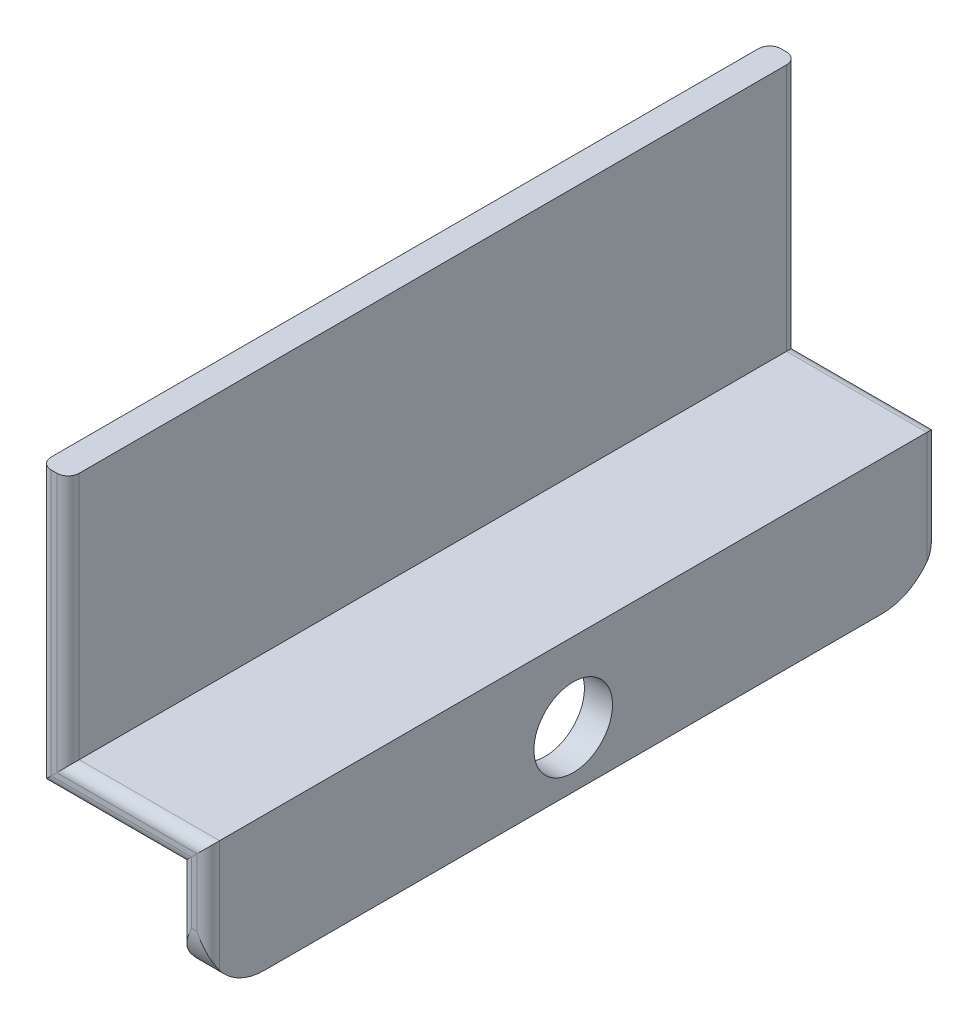
ISO-10303-21;
HEADER;
FILE_DESCRIPTION(('STEP AP214'),'2;1');
FILE_NAME('part.step','',(''),(''),'','','');
FILE_SCHEMA(('AUTOMOTIVE_DESIGN { 1 0 10303 214 1 1 1 1 }'));
ENDSEC;
DATA;
#1=APPLICATION_CONTEXT('core data for automotive mechanical design processes');
#2=APPLICATION_PROTOCOL_DEFINITION('international standard','automotive_design',2000,#1);
#3=PRODUCT_CONTEXT('',#1,'mechanical');
#4=PRODUCT('Part','Part','',(#3));
#5=PRODUCT_RELATED_PRODUCT_CATEGORY('part','',(#4));
#6=PRODUCT_DEFINITION_FORMATION('','',#4);
#7=PRODUCT_DEFINITION_CONTEXT('part definition',#1,'design');
#8=PRODUCT_DEFINITION('design','',#6,#7);
#9=PRODUCT_DEFINITION_SHAPE('','',#8);
#10=(LENGTH_UNIT() NAMED_UNIT(*) SI_UNIT(.MILLI.,.METRE.));
#11=(NAMED_UNIT(*) PLANE_ANGLE_UNIT() SI_UNIT($,.RADIAN.));
#12=(NAMED_UNIT(*) SI_UNIT($,.STERADIAN.) SOLID_ANGLE_UNIT());
#13=UNCERTAINTY_MEASURE_WITH_UNIT(LENGTH_MEASURE(1.E-05),#10,'distance_accuracy_value','');
#14=(GEOMETRIC_REPRESENTATION_CONTEXT(3) GLOBAL_UNCERTAINTY_ASSIGNED_CONTEXT((#13)) GLOBAL_UNIT_ASSIGNED_CONTEXT((#10,
#11,#12)) REPRESENTATION_CONTEXT('',''));
#15=CARTESIAN_POINT('',(0.,0.,0.));
#16=DIRECTION('',(0.,0.,1.));
#17=DIRECTION('',(1.,0.,0.));
#18=AXIS2_PLACEMENT_3D('',#15,#16,#17);
#19=CARTESIAN_POINT('',(-0.499999999999993,10.,55.));
#20=DIRECTION('',(1.,0.,0.));
#21=DIRECTION('',(0.,0.,-1.));
#22=AXIS2_PLACEMENT_3D('',#19,#20,#21);
#23=CYLINDRICAL_SURFACE('',#22,10.);
#24=DIRECTION('',(1.,0.,0.));
#25=VECTOR('',#24,1.);
#26=CARTESIAN_POINT('',(-0.499999999999993,10.,65.));
#27=LINE('',#26,#25);
#28=CARTESIAN_POINT('',(-0.499999999999993,10.,65.));
#29=VERTEX_POINT('',#28);
#30=CARTESIAN_POINT('',(0.500000000000008,10.,65.));
#31=VERTEX_POINT('',#30);
#32=EDGE_CURVE('E348',#29,#31,#27,.T.);
#33=ORIENTED_EDGE('',*,*,#32,.F.);
#34=CARTESIAN_POINT('',(-2.49999999999999,4.00000000000001,63.));
#35=CARTESIAN_POINT('',(-2.49999547043244,4.06304637753697,63.0472862882958));
#36=CARTESIAN_POINT('',(-2.49832361454912,4.12663757747305,63.093813478753));
#37=CARTESIAN_POINT('',(-2.49192859183356,4.25478005250355,63.1852695333377));
#38=CARTESIAN_POINT('',(-2.48720638983413,4.31933101771625,63.2301988981225));
#39=CARTESIAN_POINT('',(-2.46891171954804,4.51402968416605,63.3623378279782));
#40=CARTESIAN_POINT('',(-2.45120888558428,4.64547618874946,63.4470878572115));
#41=CARTESIAN_POINT('',(-2.40682523983019,4.91010869140637,63.6091190391928));
#42=CARTESIAN_POINT('',(-2.38020606759935,5.0432768704808,63.6864469043147));
#43=CARTESIAN_POINT('',(-2.31945242255605,5.31177170751565,63.8342526275325));
#44=CARTESIAN_POINT('',(-2.28531301078787,5.44709972953324,63.904725939813));
#45=CARTESIAN_POINT('',(-2.18706305090996,5.8061393307985,64.0814771097219));
#46=CARTESIAN_POINT('',(-2.11770825700137,6.03127255594251,64.1819879312216));
#47=CARTESIAN_POINT('',(-1.96662002756913,6.48468424964298,64.364955146067));
#48=CARTESIAN_POINT('',(-1.88488135721311,6.71296401101095,64.4474038680966));
#49=CARTESIAN_POINT('',(-1.7119794583594,7.17260428488559,64.5950152471494));
#50=CARTESIAN_POINT('',(-1.6207807482313,7.40397333561157,64.6601092975224));
#51=CARTESIAN_POINT('',(-1.43190515621657,7.86814150222461,64.7730351186085));
#52=CARTESIAN_POINT('',(-1.3342303647904,8.10094013484107,64.8208724279425));
#53=CARTESIAN_POINT('',(-1.11715554079996,8.60820812759128,64.9065704488633));
#54=CARTESIAN_POINT('',(-0.996936925704238,8.88286585590204,64.9412373642432));
#55=CARTESIAN_POINT('',(-0.753857161670149,9.43229712763855,64.9876693958687));
#56=CARTESIAN_POINT('',(-0.631002027540831,9.70706924260041,64.9994819850184));
#57=CARTESIAN_POINT('',(-0.505443288842875,9.98782843433309,64.99999444154));
#58=CARTESIAN_POINT('',(-0.502721632048848,9.99391424381279,64.9999999968566));
#59=CARTESIAN_POINT('',(-0.499999999999993,10.,65.));
#60=B_SPLINE_CURVE_WITH_KNOTS('',3,(#34,#35,#36,#37,#38,#39,#40,#41,#42,#43,#44,#45,#46,#47,#48,
#49,#50,#51,#52,#53,#54,#55,#56,#57,#58,#59),.UNSPECIFIED.,.F.,.F.,(4,2,2,2,2,2,2,2,2,2,2,2,4),
(0.,0.236371159892512,0.472667591527449,0.944315101861264,1.41276713949794,1.88152775757087,
2.64870335126649,3.41620414998905,4.18669550285099,4.95693934291841,5.86148159841717,
6.76414291697835,6.78414292392341),.UNSPECIFIED.);
#61=CARTESIAN_POINT('',(-2.49999999999999,4.00000000000001,63.));
#62=VERTEX_POINT('',#61);
#63=EDGE_CURVE('E11',#62,#29,#60,.T.);
#64=ORIENTED_EDGE('',*,*,#63,.F.);
#65=CARTESIAN_POINT('',(-2.49999999999999,10.,55.));
#66=DIRECTION('',(-1.,0.,0.));
#67=DIRECTION('',(0.,0.,1.));
#68=AXIS2_PLACEMENT_3D('',#65,#66,#67);
#69=CIRCLE('',#68,10.);
#70=CARTESIAN_POINT('',(-2.49999999999999,0.,55.));
#71=VERTEX_POINT('',#70);
#72=EDGE_CURVE('E50',#71,#62,#69,.T.);
#73=ORIENTED_EDGE('',*,*,#72,.F.);
#74=DIRECTION('',(1.,0.,0.));
#75=VECTOR('',#74,1.);
#76=CARTESIAN_POINT('',(0.499999999999992,0.,55.));
#77=LINE('',#76,#75);
#78=CARTESIAN_POINT('',(2.50000000000001,0.,55.));
#79=VERTEX_POINT('',#78);
#80=EDGE_CURVE('E475',#79,#71,#77,.F.);
#81=ORIENTED_EDGE('',*,*,#80,.F.);
#82=CARTESIAN_POINT('',(2.50000000000001,10.,55.));
#83=DIRECTION('',(1.,0.,0.));
#84=DIRECTION('',(0.,0.,-1.));
#85=AXIS2_PLACEMENT_3D('',#82,#83,#84);
#86=CIRCLE('',#85,10.);
#87=CARTESIAN_POINT('',(2.50000000000001,4.00000000000001,63.));
#88=VERTEX_POINT('',#87);
#89=EDGE_CURVE('E476',#88,#79,#86,.T.);
#90=ORIENTED_EDGE('',*,*,#89,.F.);
#91=CARTESIAN_POINT('',(0.500000000000008,10.,65.));
#92=CARTESIAN_POINT('',(0.502721628399615,9.99391425084165,64.9999999965994));
#93=CARTESIAN_POINT('',(0.505443285212219,9.98782844131885,64.9999944412989));
#94=CARTESIAN_POINT('',(0.642839640476698,9.68059946278816,64.999433683535));
#95=CARTESIAN_POINT('',(0.777544798684673,9.37932057803113,64.9852882408832));
#96=CARTESIAN_POINT('',(1.04327113471868,8.77740035527913,64.9295886716854));
#97=CARTESIAN_POINT('',(1.17428874575255,8.47675987815172,64.8880088990259));
#98=CARTESIAN_POINT('',(1.42867458267128,7.87673702040747,64.7767569341569));
#99=CARTESIAN_POINT('',(1.55202957555319,7.57735760535633,64.7070376217039));
#100=CARTESIAN_POINT('',(1.78572898308166,6.98194801878022,64.5387111228695));
#101=CARTESIAN_POINT('',(1.89608655158132,6.68591474005417,64.4401335005981));
#102=CARTESIAN_POINT('',(2.09232369803455,6.11354886559747,64.2187128467075));
#103=CARTESIAN_POINT('',(2.17916593611921,5.83698257130332,64.0973671885433));
#104=CARTESIAN_POINT('',(2.29024836784087,5.42797135928678,63.8949186385683));
#105=CARTESIAN_POINT('',(2.32402390435839,5.29290748653502,63.8242143371832));
#106=CARTESIAN_POINT('',(2.38402833961434,5.02484413603067,63.6759018440058));
#107=CARTESIAN_POINT('',(2.41025661874056,4.89184482862158,63.5982930860581));
#108=CARTESIAN_POINT('',(2.45026840218955,4.64893178433829,63.4488538806291));
#109=CARTESIAN_POINT('',(2.46535101868504,4.5386363826575,63.3779936451009));
#110=CARTESIAN_POINT('',(2.48791968612418,4.32044190393643,63.2316379999814));
#111=CARTESIAN_POINT('',(2.49541038857459,4.21254139925162,63.1561454586777));
#112=CARTESIAN_POINT('',(2.50153963009505,3.99856716219276,63.000031068604));
#113=CARTESIAN_POINT('',(2.50009094149456,3.89252158861953,62.9193663015082));
#114=CARTESIAN_POINT('',(2.48994271305687,3.73615542879902,62.7954277633358));
#115=CARTESIAN_POINT('',(2.48522141633947,3.68442974533144,62.75357823854));
#116=CARTESIAN_POINT('',(2.47288472291966,3.58201051799564,62.6690174067095));
#117=CARTESIAN_POINT('',(2.46526832160248,3.53131733885191,62.6263058054075));
#118=CARTESIAN_POINT('',(2.4560925472339,3.48120344431526,62.5832243449335));
#119=B_SPLINE_CURVE_WITH_KNOTS('',3,(#91,#92,#93,#94,#95,#96,#97,#98,#99,#100,#101,#102,#103,
#104,#105,#106,#107,#108,#109,#110,#111,#112,#113,#114,#115,#116,#117,#118),.UNSPECIFIED.,.F.,
.F.,(4,2,2,2,2,2,2,2,2,2,2,2,2,4),(0.,0.0200000069444667,1.00964805019351,2.00022254779432,
2.99246271075223,3.98368990203602,4.9242652636444,5.3924313134945,5.86063578772613,
6.2562352909762,6.65159226669092,7.05081306741995,7.25085282834555,7.45096206746141),.UNSPECIFIED.);
#120=EDGE_CURVE('E433',#31,#88,#119,.T.);
#121=ORIENTED_EDGE('',*,*,#120,.F.);
#122=EDGE_LOOP('',(#33,#64,#73,#81,#90,#121));
#123=FACE_BOUND('',#122,.T.);
#124=ADVANCED_FACE('F37',(#123),#23,.T.);
#125=CARTESIAN_POINT('',(-0.500000000000008,10.,-55.));
#126=DIRECTION('',(-1.,0.,0.));
#127=DIRECTION('',(0.,0.,1.));
#128=AXIS2_PLACEMENT_3D('',#125,#126,#127);
#129=CYLINDRICAL_SURFACE('',#128,10.);
#130=DIRECTION('',(-1.,0.,0.));
#131=VECTOR('',#130,1.);
#132=CARTESIAN_POINT('',(-0.500000000000008,10.,-65.));
#133=LINE('',#132,#131);
#134=CARTESIAN_POINT('',(0.499999999999992,10.,-65.));
#135=VERTEX_POINT('',#134);
#136=CARTESIAN_POINT('',(-0.500000000000008,10.,-65.));
#137=VERTEX_POINT('',#136);
#138=EDGE_CURVE('E169',#135,#137,#133,.T.);
#139=ORIENTED_EDGE('',*,*,#138,.F.);
#140=CARTESIAN_POINT('',(2.49999999999999,3.99999999999999,-63.));
#141=CARTESIAN_POINT('',(2.49999547043244,4.06304637753687,-63.0472862882957));
#142=CARTESIAN_POINT('',(2.49832361454912,4.12663757747287,-63.0938134787529));
#143=CARTESIAN_POINT('',(2.49192859183358,4.2547800525032,-63.1852695333375));
#144=CARTESIAN_POINT('',(2.48720638983416,4.31933101771581,-63.2301988981222));
#145=CARTESIAN_POINT('',(2.46891171954812,4.51402968416534,-63.3623378279777));
#146=CARTESIAN_POINT('',(2.4512088855844,4.64547618874857,-63.447087857211));
#147=CARTESIAN_POINT('',(2.40682523983037,4.91010869140545,-63.6091190391923));
#148=CARTESIAN_POINT('',(2.3802060675995,5.04327687048006,-63.6864469043143));
#149=CARTESIAN_POINT('',(2.31945242255614,5.31177170751526,-63.8342526275324));
#150=CARTESIAN_POINT('',(2.28531301078792,5.44709972953303,-63.904725939813));
#151=CARTESIAN_POINT('',(2.18706305090993,5.8061393307986,-64.0814771097219));
#152=CARTESIAN_POINT('',(2.11770825700131,6.03127255594274,-64.1819879312217));
#153=CARTESIAN_POINT('',(1.96662002756895,6.48468424964342,-64.3649551460672));
#154=CARTESIAN_POINT('',(1.88488135721282,6.71296401101147,-64.4474038680968));
#155=CARTESIAN_POINT('',(1.71197945835927,7.17260428488616,-64.5950152471496));
#156=CARTESIAN_POINT('',(1.62078074823145,7.4039733356121,-64.6601092975225));
#157=CARTESIAN_POINT('',(1.43190515621617,7.86814150222462,-64.7730351186086));
#158=CARTESIAN_POINT('',(1.33423036478917,8.10094013484059,-64.8208724279425));
#159=CARTESIAN_POINT('',(1.11715554080136,8.60820812759183,-64.9065704488633));
#160=CARTESIAN_POINT('',(0.996936925709866,8.88286585590448,-64.9412373642432));
#161=CARTESIAN_POINT('',(0.753857161664523,9.43229712763598,-64.9876693958688));
#162=CARTESIAN_POINT('',(0.631002027519763,9.70706924259096,-64.9994819850186));
#163=CARTESIAN_POINT('',(0.505443288841949,9.98782843433267,-64.99999444154));
#164=CARTESIAN_POINT('',(0.502721632048376,9.99391424381258,-64.9999999968566));
#165=CARTESIAN_POINT('',(0.499999999999992,10.,-65.));
#166=B_SPLINE_CURVE_WITH_KNOTS('',3,(#140,#141,#142,#143,#144,#145,#146,#147,#148,#149,#150,
#151,#152,#153,#154,#155,#156,#157,#158,#159,#160,#161,#162,#163,#164,#165),.UNSPECIFIED.,.F.,
.F.,(4,2,2,2,2,2,2,2,2,2,2,2,4),(0.,0.236371159892205,0.47266759152683,0.944315101860007,
1.4127671394973,1.88152775757086,2.6487033512669,3.4162041499898,4.1866955028513,
4.95693934291837,5.8614815984171,6.76414291697836,6.78414292392343),.UNSPECIFIED.);
#167=CARTESIAN_POINT('',(2.49999999999999,3.99999999999999,-63.));
#168=VERTEX_POINT('',#167);
#169=EDGE_CURVE('E340',#168,#135,#166,.T.);
#170=ORIENTED_EDGE('',*,*,#169,.F.);
#171=CARTESIAN_POINT('',(2.49999999999999,10.,-55.));
#172=DIRECTION('',(1.,0.,0.));
#173=DIRECTION('',(0.,0.,-1.));
#174=AXIS2_PLACEMENT_3D('',#171,#172,#173);
#175=CIRCLE('',#174,10.);
#176=CARTESIAN_POINT('',(2.49999999999999,0.,-55.));
#177=VERTEX_POINT('',#176);
#178=EDGE_CURVE('E349',#177,#168,#175,.T.);
#179=ORIENTED_EDGE('',*,*,#178,.F.);
#180=DIRECTION('',(-1.,0.,0.));
#181=VECTOR('',#180,1.);
#182=CARTESIAN_POINT('',(0.499999999999992,0.,-55.));
#183=LINE('',#182,#181);
#184=CARTESIAN_POINT('',(-2.50000000000001,0.,-55.));
#185=VERTEX_POINT('',#184);
#186=EDGE_CURVE('E675',#185,#177,#183,.F.);
#187=ORIENTED_EDGE('',*,*,#186,.F.);
#188=CARTESIAN_POINT('',(-2.50000000000001,10.,-55.));
#189=DIRECTION('',(-1.,0.,0.));
#190=DIRECTION('',(0.,0.,1.));
#191=AXIS2_PLACEMENT_3D('',#188,#189,#190);
#192=CIRCLE('',#191,10.);
#193=CARTESIAN_POINT('',(-2.50000000000001,3.99999999999999,-63.));
#194=VERTEX_POINT('',#193);
#195=EDGE_CURVE('E326',#194,#185,#192,.T.);
#196=ORIENTED_EDGE('',*,*,#195,.F.);
#197=CARTESIAN_POINT('',(-0.500000000000008,10.,-65.));
#198=CARTESIAN_POINT('',(-0.502721628399066,9.99391425084141,-64.9999999965994));
#199=CARTESIAN_POINT('',(-0.505443285211139,9.98782844131837,-64.9999944412989));
#200=CARTESIAN_POINT('',(-0.642839640444456,9.68059946278795,-64.9994336835353));
#201=CARTESIAN_POINT('',(-0.777544798666836,9.37932057805158,-64.9852882408844));
#202=CARTESIAN_POINT('',(-1.04327113470509,8.77740035532974,-64.9295886716909));
#203=CARTESIAN_POINT('',(-1.17428874572878,8.47675987821183,-64.8880088990346));
#204=CARTESIAN_POINT('',(-1.42867458263471,7.87673702048958,-64.7767569341746));
#205=CARTESIAN_POINT('',(-1.55202957551402,7.57735760545096,-64.7070376217272));
#206=CARTESIAN_POINT('',(-1.78572898303726,6.98194801889843,-64.5387111229064));
#207=CARTESIAN_POINT('',(-1.89608655153428,6.68591474018346,-64.440133500643));
#208=CARTESIAN_POINT('',(-2.09232369799681,6.11354886571502,-64.2187128467578));
#209=CARTESIAN_POINT('',(-2.1791659360912,5.83698257139857,-64.0973671885877));
#210=CARTESIAN_POINT('',(-2.29024836782501,5.42797135934904,-63.8949186386005));
#211=CARTESIAN_POINT('',(-2.3240239043462,5.2929074865863,-63.8242143372107));
#212=CARTESIAN_POINT('',(-2.38402833960843,5.02484413606024,-63.675901844023));
#213=CARTESIAN_POINT('',(-2.41025661873727,4.89184482864045,-63.5982930860695));
#214=CARTESIAN_POINT('',(-2.45026840218792,4.64893178434909,-63.448853880636));
#215=CARTESIAN_POINT('',(-2.46535101868332,4.53863638267071,-63.3779936451095));
#216=CARTESIAN_POINT('',(-2.48791968612268,4.32044190395432,-63.2316379999937));
#217=CARTESIAN_POINT('',(-2.49541038857339,4.21254139927179,-63.156145458692));
#218=CARTESIAN_POINT('',(-2.50153963009495,3.99856716221775,-63.0000310686227));
#219=CARTESIAN_POINT('',(-2.5000909414953,3.89252158864704,-62.9193663015294));
#220=CARTESIAN_POINT('',(-2.48994271305941,3.73615542883011,-62.7954277633608));
#221=CARTESIAN_POINT('',(-2.4852214163427,3.68442974536369,-62.7535782385662));
#222=CARTESIAN_POINT('',(-2.47288472292447,3.58201051803014,-62.6690174067384));
#223=CARTESIAN_POINT('',(-2.46526832160818,3.53131733888749,-62.6263058054377));
#224=CARTESIAN_POINT('',(-2.45609254724062,3.48120344435189,-62.583224344965));
#225=B_SPLINE_CURVE_WITH_KNOTS('',3,(#197,#198,#199,#200,#201,#202,#203,#204,#205,#206,#207,
#208,#209,#210,#211,#212,#213,#214,#215,#216,#217,#218,#219,#220,#221,#222,#223,#224),
.UNSPECIFIED.,.F.,.F.,(4,2,2,2,2,2,2,2,2,2,2,2,2,4),(0.,0.0200000069444654,1.00964805015461,
2.00022254771616,2.99246271063398,3.98368990187851,4.92426526356025,5.39243131344749,
5.86063578771627,6.25623529095746,6.65159226666328,7.05081306738183,7.25085282830217,
7.45096206741274),.UNSPECIFIED.);
#226=EDGE_CURVE('E202',#137,#194,#225,.T.);
#227=ORIENTED_EDGE('',*,*,#226,.F.);
#228=EDGE_LOOP('',(#139,#170,#179,#187,#196,#227));
#229=FACE_BOUND('',#228,.T.);
#230=ADVANCED_FACE('F331',(#229),#129,.T.);
#231=CARTESIAN_POINT('',(-24.5,68.2,-63.0000000000001));
#232=DIRECTION('',(0.,-1.,0.));
#233=DIRECTION('',(0.,0.,-1.));
#234=AXIS2_PLACEMENT_3D('',#231,#232,#233);
#235=PLANE('',#234);
#236=CARTESIAN_POINT('',(-24.5,68.2,-63.0000000000001));
#237=DIRECTION('',(0.,1.,0.));
#238=DIRECTION('',(0.,0.,-1.));
#239=AXIS2_PLACEMENT_3D('',#236,#237,#238);
#240=CIRCLE('',#239,2.);
#241=CARTESIAN_POINT('',(-22.5,68.2,-63.0000000000001));
#242=VERTEX_POINT('',#241);
#243=CARTESIAN_POINT('',(-24.5,68.2,-65.0000000000001));
#244=VERTEX_POINT('',#243);
#245=EDGE_CURVE('E278',#242,#244,#240,.T.);
#246=ORIENTED_EDGE('',*,*,#245,.T.);
#247=DIRECTION('',(-1.,0.,0.));
#248=VECTOR('',#247,1.);
#249=CARTESIAN_POINT('',(-25.5,68.2,-65.0000000000001));
#250=LINE('',#249,#248);
#251=CARTESIAN_POINT('',(-25.5,68.2,-65.0000000000001));
#252=VERTEX_POINT('',#251);
#253=EDGE_CURVE('E293',#244,#252,#250,.T.);
#254=ORIENTED_EDGE('',*,*,#253,.T.);
#255=CARTESIAN_POINT('',(-25.5,68.2,-63.0000000000001));
#256=DIRECTION('',(0.,1.,0.));
#257=DIRECTION('',(0.,0.,-1.));
#258=AXIS2_PLACEMENT_3D('',#255,#256,#257);
#259=CIRCLE('',#258,2.);
#260=CARTESIAN_POINT('',(-27.5,68.2,-63.0000000000001));
#261=VERTEX_POINT('',#260);
#262=EDGE_CURVE('E291',#252,#261,#259,.T.);
#263=ORIENTED_EDGE('',*,*,#262,.T.);
#264=DIRECTION('',(0.,0.,1.));
#265=VECTOR('',#264,1.);
#266=CARTESIAN_POINT('',(-27.5,68.2,-63.0000000000001));
#267=LINE('',#266,#265);
#268=CARTESIAN_POINT('',(-27.5,68.2,62.9999999999999));
#269=VERTEX_POINT('',#268);
#270=EDGE_CURVE('E289',#261,#269,#267,.T.);
#271=ORIENTED_EDGE('',*,*,#270,.T.);
#272=CARTESIAN_POINT('',(-25.5,68.2,62.9999999999999));
#273=DIRECTION('',(0.,1.,0.));
#274=DIRECTION('',(0.,0.,-1.));
#275=AXIS2_PLACEMENT_3D('',#272,#273,#274);
#276=CIRCLE('',#275,2.);
#277=CARTESIAN_POINT('',(-25.5,68.2,64.9999999999999));
#278=VERTEX_POINT('',#277);
#279=EDGE_CURVE('E287',#269,#278,#276,.T.);
#280=ORIENTED_EDGE('',*,*,#279,.T.);
#281=DIRECTION('',(1.,0.,0.));
#282=VECTOR('',#281,1.);
#283=CARTESIAN_POINT('',(-25.5,68.2,64.9999999999999));
#284=LINE('',#283,#282);
#285=CARTESIAN_POINT('',(-24.5,68.2,64.9999999999999));
#286=VERTEX_POINT('',#285);
#287=EDGE_CURVE('E285',#278,#286,#284,.T.);
#288=ORIENTED_EDGE('',*,*,#287,.T.);
#289=CARTESIAN_POINT('',(-24.5,68.2,62.9999999999999));
#290=DIRECTION('',(0.,1.,0.));
#291=DIRECTION('',(0.,0.,-1.));
#292=AXIS2_PLACEMENT_3D('',#289,#290,#291);
#293=CIRCLE('',#292,2.);
#294=CARTESIAN_POINT('',(-22.5,68.2,62.9999999999999));
#295=VERTEX_POINT('',#294);
#296=EDGE_CURVE('E283',#286,#295,#293,.T.);
#297=ORIENTED_EDGE('',*,*,#296,.T.);
#298=DIRECTION('',(0.,0.,-1.));
#299=VECTOR('',#298,1.);
#300=CARTESIAN_POINT('',(-22.5,68.2,-63.0000000000001));
#301=LINE('',#300,#299);
#302=EDGE_CURVE('E280',#295,#242,#301,.T.);
#303=ORIENTED_EDGE('',*,*,#302,.T.);
#304=EDGE_LOOP('',(#246,#254,#263,#271,#280,#288,#297,#303));
#305=FACE_BOUND('',#304,.T.);
#306=ADVANCED_FACE('F335',(#305),#235,.F.);
#307=CARTESIAN_POINT('',(0.499999999999992,0.,-63.));
#308=DIRECTION('',(0.,-1.,0.));
#309=DIRECTION('',(0.,0.,-1.));
#310=AXIS2_PLACEMENT_3D('',#307,#308,#309);
#311=PLANE('',#310);
#312=DIRECTION('',(0.,0.,-1.));
#313=VECTOR('',#312,1.);
#314=CARTESIAN_POINT('',(2.49999999999999,0.,-63.));
#315=LINE('',#314,#313);
#316=EDGE_CURVE('E224',#79,#177,#315,.T.);
#317=ORIENTED_EDGE('',*,*,#316,.F.);
#318=ORIENTED_EDGE('',*,*,#80,.T.);
#319=DIRECTION('',(0.,0.,1.));
#320=VECTOR('',#319,1.);
#321=CARTESIAN_POINT('',(-2.50000000000001,0.,-63.));
#322=LINE('',#321,#320);
#323=EDGE_CURVE('E227',#185,#71,#322,.T.);
#324=ORIENTED_EDGE('',*,*,#323,.F.);
#325=ORIENTED_EDGE('',*,*,#186,.T.);
#326=EDGE_LOOP('',(#317,#318,#324,#325));
#327=FACE_BOUND('',#326,.T.);
#328=ADVANCED_FACE('F392',(#327),#311,.T.);
#329=CARTESIAN_POINT('',(-25.5,18.6499999999999,-65.0000000000001));
#330=DIRECTION('',(0.,0.,-1.));
#331=DIRECTION('',(0.,1.,0.));
#332=AXIS2_PLACEMENT_3D('',#329,#330,#331);
#333=PLANE('',#332);
#334=DIRECTION('',(0.707106781186548,0.707106781186548,0.));
#335=VECTOR('',#334,1.);
#336=CARTESIAN_POINT('',(-11.3249999999999,35.175,-65.0000000000001));
#337=LINE('',#336,#335);
#338=CARTESIAN_POINT('',(-25.5,20.9999999999999,-65.0000000000001));
#339=VERTEX_POINT('',#338);
#340=CARTESIAN_POINT('',(-24.5,21.9999999999999,-65.0000000000001));
#341=VERTEX_POINT('',#340);
#342=EDGE_CURVE('E258',#339,#341,#337,.T.);
#343=ORIENTED_EDGE('',*,*,#342,.F.);
#344=DIRECTION('',(0.,1.,0.));
#345=VECTOR('',#344,1.);
#346=CARTESIAN_POINT('',(-25.5,18.6499999999999,-65.0000000000001));
#347=LINE('',#346,#345);
#348=EDGE_CURVE('E313',#339,#252,#347,.T.);
#349=ORIENTED_EDGE('',*,*,#348,.T.);
#350=ORIENTED_EDGE('',*,*,#253,.F.);
#351=DIRECTION('',(0.,1.,0.));
#352=VECTOR('',#351,1.);
#353=CARTESIAN_POINT('',(-24.5,18.6499999999999,-65.0000000000001));
#354=LINE('',#353,#352);
#355=EDGE_CURVE('E263',#341,#244,#354,.T.);
#356=ORIENTED_EDGE('',*,*,#355,.F.);
#357=EDGE_LOOP('',(#343,#349,#350,#356));
#358=FACE_BOUND('',#357,.T.);
#359=ADVANCED_FACE('F388',(#358),#333,.T.);
#360=CARTESIAN_POINT('',(-25.5,18.6499999999999,-63.0000000000001));
#361=DIRECTION('',(0.,1.,0.));
#362=DIRECTION('',(0.,0.,1.));
#363=AXIS2_PLACEMENT_3D('',#360,#361,#362);
#364=CYLINDRICAL_SURFACE('',#363,2.);
#365=CARTESIAN_POINT('',(-25.5,20.9999999999998,-63.0000000000001));
#366=DIRECTION('',(-0.707106781186547,0.707106781186547,0.));
#367=DIRECTION('',(-0.707106781186548,-0.707106781186548,0.));
#368=AXIS2_PLACEMENT_3D('',#365,#366,#367);
#369=ELLIPSE('',#368,2.82842712474619,2.);
#370=CARTESIAN_POINT('',(-27.5,18.9999999999999,-63.0000000000001));
#371=VERTEX_POINT('',#370);
#372=EDGE_CURVE('E195',#371,#339,#369,.F.);
#373=ORIENTED_EDGE('',*,*,#372,.F.);
#374=DIRECTION('',(0.,1.,0.));
#375=VECTOR('',#374,1.);
#376=CARTESIAN_POINT('',(-27.5,18.6499999999999,-63.0000000000001));
#377=LINE('',#376,#375);
#378=EDGE_CURVE('E310',#371,#261,#377,.T.);
#379=ORIENTED_EDGE('',*,*,#378,.T.);
#380=ORIENTED_EDGE('',*,*,#262,.F.);
#381=ORIENTED_EDGE('',*,*,#348,.F.);
#382=EDGE_LOOP('',(#373,#379,#380,#381));
#383=FACE_BOUND('',#382,.T.);
#384=ADVANCED_FACE('F391',(#383),#364,.T.);
#385=CARTESIAN_POINT('',(-27.5,18.6499999999999,-63.0000000000001));
#386=DIRECTION('',(-1.,0.,0.));
#387=DIRECTION('',(0.,0.,1.));
#388=AXIS2_PLACEMENT_3D('',#385,#386,#387);
#389=PLANE('',#388);
#390=DIRECTION('',(0.,0.,-1.));
#391=VECTOR('',#390,1.);
#392=CARTESIAN_POINT('',(-27.5,18.9999999999998,-63.));
#393=LINE('',#392,#391);
#394=CARTESIAN_POINT('',(-27.5,19.0000000000001,62.9999999999999));
#395=VERTEX_POINT('',#394);
#396=EDGE_CURVE('E240',#395,#371,#393,.T.);
#397=ORIENTED_EDGE('',*,*,#396,.F.);
#398=DIRECTION('',(0.,1.,0.));
#399=VECTOR('',#398,1.);
#400=CARTESIAN_POINT('',(-27.5,18.6499999999999,62.9999999999999));
#401=LINE('',#400,#399);
#402=EDGE_CURVE('E307',#395,#269,#401,.T.);
#403=ORIENTED_EDGE('',*,*,#402,.T.);
#404=ORIENTED_EDGE('',*,*,#270,.F.);
#405=ORIENTED_EDGE('',*,*,#378,.F.);
#406=EDGE_LOOP('',(#397,#403,#404,#405));
#407=FACE_BOUND('',#406,.T.);
#408=ADVANCED_FACE('F396',(#407),#389,.T.);
#409=CARTESIAN_POINT('',(-25.5,18.6499999999999,62.9999999999999));
#410=DIRECTION('',(0.,1.,0.));
#411=DIRECTION('',(0.,0.,1.));
#412=AXIS2_PLACEMENT_3D('',#409,#410,#411);
#413=CYLINDRICAL_SURFACE('',#412,2.);
#414=CARTESIAN_POINT('',(-25.5,21.0000000000001,62.9999999999999));
#415=DIRECTION('',(-0.707106781186547,0.707106781186547,0.));
#416=DIRECTION('',(-0.707106781186548,-0.707106781186548,0.));
#417=AXIS2_PLACEMENT_3D('',#414,#415,#416);
#418=ELLIPSE('',#417,2.82842712474619,2.);
#419=CARTESIAN_POINT('',(-25.5,21.0000000000001,64.9999999999999));
#420=VERTEX_POINT('',#419);
#421=EDGE_CURVE('E243',#420,#395,#418,.F.);
#422=ORIENTED_EDGE('',*,*,#421,.F.);
#423=DIRECTION('',(0.,1.,0.));
#424=VECTOR('',#423,1.);
#425=CARTESIAN_POINT('',(-25.5,18.6499999999999,64.9999999999999));
#426=LINE('',#425,#424);
#427=EDGE_CURVE('E304',#420,#278,#426,.T.);
#428=ORIENTED_EDGE('',*,*,#427,.T.);
#429=ORIENTED_EDGE('',*,*,#279,.F.);
#430=ORIENTED_EDGE('',*,*,#402,.F.);
#431=EDGE_LOOP('',(#422,#428,#429,#430));
#432=FACE_BOUND('',#431,.T.);
#433=ADVANCED_FACE('F400',(#432),#413,.T.);
#434=CARTESIAN_POINT('',(-25.5,18.6499999999999,64.9999999999999));
#435=DIRECTION('',(0.,0.,1.));
#436=DIRECTION('',(0.,-1.,0.));
#437=AXIS2_PLACEMENT_3D('',#434,#435,#436);
#438=PLANE('',#437);
#439=DIRECTION('',(-0.707106781186548,-0.707106781186548,0.));
#440=VECTOR('',#439,1.);
#441=CARTESIAN_POINT('',(-11.325,35.1750000000001,64.9999999999999));
#442=LINE('',#441,#440);
#443=CARTESIAN_POINT('',(-24.5,22.0000000000001,64.9999999999999));
#444=VERTEX_POINT('',#443);
#445=EDGE_CURVE('E246',#444,#420,#442,.T.);
#446=ORIENTED_EDGE('',*,*,#445,.F.);
#447=DIRECTION('',(0.,1.,0.));
#448=VECTOR('',#447,1.);
#449=CARTESIAN_POINT('',(-24.5,18.6499999999999,64.9999999999999));
#450=LINE('',#449,#448);
#451=EDGE_CURVE('E301',#444,#286,#450,.T.);
#452=ORIENTED_EDGE('',*,*,#451,.T.);
#453=ORIENTED_EDGE('',*,*,#287,.F.);
#454=ORIENTED_EDGE('',*,*,#427,.F.);
#455=EDGE_LOOP('',(#446,#452,#453,#454));
#456=FACE_BOUND('',#455,.T.);
#457=ADVANCED_FACE('F404',(#456),#438,.T.);
#458=CARTESIAN_POINT('',(-24.5,18.6499999999999,62.9999999999999));
#459=DIRECTION('',(0.,1.,0.));
#460=DIRECTION('',(0.,0.,1.));
#461=AXIS2_PLACEMENT_3D('',#458,#459,#460);
#462=CYLINDRICAL_SURFACE('',#461,2.);
#463=CARTESIAN_POINT('',(-24.5,22.0000000000001,62.9999999999999));
#464=DIRECTION('',(-0.707106781186547,0.707106781186547,0.));
#465=DIRECTION('',(-0.707106781186548,-0.707106781186548,0.));
#466=AXIS2_PLACEMENT_3D('',#463,#464,#465);
#467=ELLIPSE('',#466,2.82842712474619,2.);
#468=CARTESIAN_POINT('',(-22.5,24.0000000000001,62.9999999999999));
#469=VERTEX_POINT('',#468);
#470=EDGE_CURVE('E249',#469,#444,#467,.F.);
#471=ORIENTED_EDGE('',*,*,#470,.F.);
#472=DIRECTION('',(0.,1.,0.));
#473=VECTOR('',#472,1.);
#474=CARTESIAN_POINT('',(-22.5,18.6499999999999,62.9999999999999));
#475=LINE('',#474,#473);
#476=EDGE_CURVE('E298',#469,#295,#475,.T.);
#477=ORIENTED_EDGE('',*,*,#476,.T.);
#478=ORIENTED_EDGE('',*,*,#296,.F.);
#479=ORIENTED_EDGE('',*,*,#451,.F.);
#480=EDGE_LOOP('',(#471,#477,#478,#479));
#481=FACE_BOUND('',#480,.T.);
#482=ADVANCED_FACE('F408',(#481),#462,.T.);
#483=CARTESIAN_POINT('',(-22.5,18.6499999999999,-63.0000000000001));
#484=DIRECTION('',(1.,0.,0.));
#485=DIRECTION('',(0.,0.,-1.));
#486=AXIS2_PLACEMENT_3D('',#483,#484,#485);
#487=PLANE('',#486);
#488=DIRECTION('',(0.,0.,1.));
#489=VECTOR('',#488,1.);
#490=CARTESIAN_POINT('',(-22.5,23.9999999999998,-63.));
#491=LINE('',#490,#489);
#492=CARTESIAN_POINT('',(-22.5,23.9999999999999,-63.0000000000001));
#493=VERTEX_POINT('',#492);
#494=EDGE_CURVE('E252',#493,#469,#491,.T.);
#495=ORIENTED_EDGE('',*,*,#494,.F.);
#496=DIRECTION('',(0.,1.,0.));
#497=VECTOR('',#496,1.);
#498=CARTESIAN_POINT('',(-22.5,18.6499999999999,-63.0000000000001));
#499=LINE('',#498,#497);
#500=EDGE_CURVE('E295',#493,#242,#499,.T.);
#501=ORIENTED_EDGE('',*,*,#500,.T.);
#502=ORIENTED_EDGE('',*,*,#302,.F.);
#503=ORIENTED_EDGE('',*,*,#476,.F.);
#504=EDGE_LOOP('',(#495,#501,#502,#503));
#505=FACE_BOUND('',#504,.T.);
#506=ADVANCED_FACE('F412',(#505),#487,.T.);
#507=CARTESIAN_POINT('',(-24.5,18.6499999999999,-63.0000000000001));
#508=DIRECTION('',(0.,1.,0.));
#509=DIRECTION('',(0.,0.,1.));
#510=AXIS2_PLACEMENT_3D('',#507,#508,#509);
#511=CYLINDRICAL_SURFACE('',#510,2.);
#512=CARTESIAN_POINT('',(-24.5,21.9999999999998,-63.0000000000001));
#513=DIRECTION('',(-0.707106781186547,0.707106781186547,0.));
#514=DIRECTION('',(-0.707106781186548,-0.707106781186548,0.));
#515=AXIS2_PLACEMENT_3D('',#512,#513,#514);
#516=ELLIPSE('',#515,2.82842712474619,2.);
#517=EDGE_CURVE('E255',#341,#493,#516,.F.);
#518=ORIENTED_EDGE('',*,*,#517,.F.);
#519=ORIENTED_EDGE('',*,*,#355,.T.);
#520=ORIENTED_EDGE('',*,*,#245,.F.);
#521=ORIENTED_EDGE('',*,*,#500,.F.);
#522=EDGE_LOOP('',(#518,#519,#520,#521));
#523=FACE_BOUND('',#522,.T.);
#524=ADVANCED_FACE('F386',(#523),#511,.T.);
#525=CARTESIAN_POINT('',(2.85000000000021,21.9999999999998,-63.));
#526=DIRECTION('',(-1.,0.,0.));
#527=DIRECTION('',(0.,0.,1.));
#528=AXIS2_PLACEMENT_3D('',#525,#526,#527);
#529=CYLINDRICAL_SURFACE('',#528,2.);
#530=DIRECTION('',(-1.,0.,0.));
#531=VECTOR('',#530,1.);
#532=CARTESIAN_POINT('',(2.85000000000021,21.9999999999998,-65.));
#533=LINE('',#532,#531);
#534=CARTESIAN_POINT('',(0.49999999999999,21.9999999999998,-65.));
#535=VERTEX_POINT('',#534);
#536=EDGE_CURVE('E184',#535,#341,#533,.T.);
#537=ORIENTED_EDGE('',*,*,#536,.T.);
#538=ORIENTED_EDGE('',*,*,#517,.T.);
#539=DIRECTION('',(-1.,0.,0.));
#540=VECTOR('',#539,1.);
#541=CARTESIAN_POINT('',(2.85000000000021,23.9999999999998,-63.));
#542=LINE('',#541,#540);
#543=CARTESIAN_POINT('',(2.49999999999999,23.9999999999999,-63.));
#544=VERTEX_POINT('',#543);
#545=EDGE_CURVE('E259',#544,#493,#542,.T.);
#546=ORIENTED_EDGE('',*,*,#545,.F.);
#547=CARTESIAN_POINT('',(0.499999999999992,21.9999999999999,-63.));
#548=DIRECTION('',(-0.707106781186547,0.707106781186547,0.));
#549=DIRECTION('',(0.707106781186548,0.707106781186548,0.));
#550=AXIS2_PLACEMENT_3D('',#547,#548,#549);
#551=ELLIPSE('',#550,2.82842712474619,2.);
#552=EDGE_CURVE('E185',#535,#544,#551,.F.);
#553=ORIENTED_EDGE('',*,*,#552,.F.);
#554=EDGE_LOOP('',(#537,#538,#546,#553));
#555=FACE_BOUND('',#554,.T.);
#556=ADVANCED_FACE('F382',(#555),#529,.T.);
#557=CARTESIAN_POINT('',(2.85000000000021,23.9999999999998,-63.));
#558=DIRECTION('',(0.,1.,0.));
#559=DIRECTION('',(0.,0.,1.));
#560=AXIS2_PLACEMENT_3D('',#557,#558,#559);
#561=PLANE('',#560);
#562=ORIENTED_EDGE('',*,*,#545,.T.);
#563=ORIENTED_EDGE('',*,*,#494,.T.);
#564=DIRECTION('',(-1.,0.,0.));
#565=VECTOR('',#564,1.);
#566=CARTESIAN_POINT('',(2.85000000000002,24.0000000000001,63.));
#567=LINE('',#566,#565);
#568=CARTESIAN_POINT('',(2.50000000000001,24.0000000000001,63.));
#569=VERTEX_POINT('',#568);
#570=EDGE_CURVE('E262',#569,#469,#567,.T.);
#571=ORIENTED_EDGE('',*,*,#570,.F.);
#572=DIRECTION('',(0.,0.,1.));
#573=VECTOR('',#572,1.);
#574=CARTESIAN_POINT('',(2.49999999999999,23.9999999999999,-63.0000000000001));
#575=LINE('',#574,#573);
#576=EDGE_CURVE('E218',#544,#569,#575,.T.);
#577=ORIENTED_EDGE('',*,*,#576,.F.);
#578=EDGE_LOOP('',(#562,#563,#571,#577));
#579=FACE_BOUND('',#578,.T.);
#580=ADVANCED_FACE('F378',(#579),#561,.T.);
#581=CARTESIAN_POINT('',(2.85000000000002,22.0000000000001,63.));
#582=DIRECTION('',(-1.,0.,0.));
#583=DIRECTION('',(0.,0.,1.));
#584=AXIS2_PLACEMENT_3D('',#581,#582,#583);
#585=CYLINDRICAL_SURFACE('',#584,2.);
#586=ORIENTED_EDGE('',*,*,#570,.T.);
#587=ORIENTED_EDGE('',*,*,#470,.T.);
#588=DIRECTION('',(-1.,0.,0.));
#589=VECTOR('',#588,1.);
#590=CARTESIAN_POINT('',(2.85000000000001,22.0000000000001,65.));
#591=LINE('',#590,#589);
#592=CARTESIAN_POINT('',(0.500000000000007,22.0000000000002,65.));
#593=VERTEX_POINT('',#592);
#594=EDGE_CURVE('E266',#593,#444,#591,.T.);
#595=ORIENTED_EDGE('',*,*,#594,.F.);
#596=CARTESIAN_POINT('',(0.500000000000008,22.0000000000001,63.));
#597=DIRECTION('',(-0.707106781186547,0.707106781186547,0.));
#598=DIRECTION('',(0.707106781186548,0.707106781186548,0.));
#599=AXIS2_PLACEMENT_3D('',#596,#597,#598);
#600=ELLIPSE('',#599,2.82842712474619,2.);
#601=EDGE_CURVE('E215',#569,#593,#600,.F.);
#602=ORIENTED_EDGE('',*,*,#601,.F.);
#603=EDGE_LOOP('',(#586,#587,#595,#602));
#604=FACE_BOUND('',#603,.T.);
#605=ADVANCED_FACE('F374',(#604),#585,.T.);
#606=CARTESIAN_POINT('',(2.85000000000001,21.0000000000001,65.));
#607=DIRECTION('',(0.,0.,1.));
#608=DIRECTION('',(0.,-1.,0.));
#609=AXIS2_PLACEMENT_3D('',#606,#607,#608);
#610=PLANE('',#609);
#611=ORIENTED_EDGE('',*,*,#594,.T.);
#612=ORIENTED_EDGE('',*,*,#445,.T.);
#613=DIRECTION('',(-1.,0.,0.));
#614=VECTOR('',#613,1.);
#615=CARTESIAN_POINT('',(2.85000000000001,21.0000000000001,65.));
#616=LINE('',#615,#614);
#617=CARTESIAN_POINT('',(-0.499999999999994,21.0000000000001,65.));
#618=VERTEX_POINT('',#617);
#619=EDGE_CURVE('E269',#618,#420,#616,.T.);
#620=ORIENTED_EDGE('',*,*,#619,.F.);
#621=DIRECTION('',(-0.707106781186548,-0.707106781186548,0.));
#622=VECTOR('',#621,1.);
#623=CARTESIAN_POINT('',(-11.0000000000001,10.5000000000001,65.));
#624=LINE('',#623,#622);
#625=EDGE_CURVE('E212',#593,#618,#624,.T.);
#626=ORIENTED_EDGE('',*,*,#625,.F.);
#627=EDGE_LOOP('',(#611,#612,#620,#626));
#628=FACE_BOUND('',#627,.T.);
#629=ADVANCED_FACE('F370',(#628),#610,.T.);
#630=CARTESIAN_POINT('',(2.85000000000002,21.0000000000001,63.));
#631=DIRECTION('',(-1.,0.,0.));
#632=DIRECTION('',(0.,0.,1.));
#633=AXIS2_PLACEMENT_3D('',#630,#631,#632);
#634=CYLINDRICAL_SURFACE('',#633,2.);
#635=ORIENTED_EDGE('',*,*,#619,.T.);
#636=ORIENTED_EDGE('',*,*,#421,.T.);
#637=DIRECTION('',(-1.,0.,0.));
#638=VECTOR('',#637,1.);
#639=CARTESIAN_POINT('',(2.85000000000002,19.0000000000001,63.));
#640=LINE('',#639,#638);
#641=CARTESIAN_POINT('',(-2.5,19.0000000000001,63.));
#642=VERTEX_POINT('',#641);
#643=EDGE_CURVE('E272',#642,#395,#640,.T.);
#644=ORIENTED_EDGE('',*,*,#643,.F.);
#645=CARTESIAN_POINT('',(-0.499999999999993,21.0000000000001,63.));
#646=DIRECTION('',(-0.707106781186547,0.707106781186547,0.));
#647=DIRECTION('',(0.707106781186548,0.707106781186548,0.));
#648=AXIS2_PLACEMENT_3D('',#645,#646,#647);
#649=ELLIPSE('',#648,2.82842712474619,2.);
#650=EDGE_CURVE('E205',#618,#642,#649,.F.);
#651=ORIENTED_EDGE('',*,*,#650,.F.);
#652=EDGE_LOOP('',(#635,#636,#644,#651));
#653=FACE_BOUND('',#652,.T.);
#654=ADVANCED_FACE('F366',(#653),#634,.T.);
#655=CARTESIAN_POINT('',(2.85000000000021,18.9999999999998,-63.));
#656=DIRECTION('',(0.,-1.,0.));
#657=DIRECTION('',(0.,0.,-1.));
#658=AXIS2_PLACEMENT_3D('',#655,#656,#657);
#659=PLANE('',#658);
#660=ORIENTED_EDGE('',*,*,#643,.T.);
#661=ORIENTED_EDGE('',*,*,#396,.T.);
#662=DIRECTION('',(-1.,0.,0.));
#663=VECTOR('',#662,1.);
#664=CARTESIAN_POINT('',(2.85000000000021,18.9999999999998,-63.));
#665=LINE('',#664,#663);
#666=CARTESIAN_POINT('',(-2.50000000000001,18.9999999999999,-63.));
#667=VERTEX_POINT('',#666);
#668=EDGE_CURVE('E196',#667,#371,#665,.T.);
#669=ORIENTED_EDGE('',*,*,#668,.F.);
#670=DIRECTION('',(0.,0.,-1.));
#671=VECTOR('',#670,1.);
#672=CARTESIAN_POINT('',(-2.50000000000001,18.9999999999999,-63.));
#673=LINE('',#672,#671);
#674=EDGE_CURVE('E200',#642,#667,#673,.T.);
#675=ORIENTED_EDGE('',*,*,#674,.F.);
#676=EDGE_LOOP('',(#660,#661,#669,#675));
#677=FACE_BOUND('',#676,.T.);
#678=ADVANCED_FACE('F363',(#677),#659,.T.);
#679=CARTESIAN_POINT('',(2.85000000000021,20.9999999999998,-63.));
#680=DIRECTION('',(-1.,0.,0.));
#681=DIRECTION('',(0.,0.,1.));
#682=AXIS2_PLACEMENT_3D('',#679,#680,#681);
#683=CYLINDRICAL_SURFACE('',#682,2.);
#684=ORIENTED_EDGE('',*,*,#668,.T.);
#685=ORIENTED_EDGE('',*,*,#372,.T.);
#686=DIRECTION('',(-1.,0.,0.));
#687=VECTOR('',#686,1.);
#688=CARTESIAN_POINT('',(2.85000000000021,20.9999999999998,-65.));
#689=LINE('',#688,#687);
#690=CARTESIAN_POINT('',(-0.50000000000001,20.9999999999998,-65.));
#691=VERTEX_POINT('',#690);
#692=EDGE_CURVE('E182',#691,#339,#689,.T.);
#693=ORIENTED_EDGE('',*,*,#692,.F.);
#694=CARTESIAN_POINT('',(-0.500000000000008,20.9999999999999,-63.));
#695=DIRECTION('',(-0.707106781186547,0.707106781186547,0.));
#696=DIRECTION('',(0.707106781186548,0.707106781186548,0.));
#697=AXIS2_PLACEMENT_3D('',#694,#695,#696);
#698=ELLIPSE('',#697,2.82842712474619,2.);
#699=EDGE_CURVE('E193',#667,#691,#698,.F.);
#700=ORIENTED_EDGE('',*,*,#699,.F.);
#701=EDGE_LOOP('',(#684,#685,#693,#700));
#702=FACE_BOUND('',#701,.T.);
#703=ADVANCED_FACE('F192',(#702),#683,.T.);
#704=CARTESIAN_POINT('',(2.85000000000021,20.9999999999998,-65.));
#705=DIRECTION('',(0.,0.,-1.));
#706=DIRECTION('',(0.,1.,0.));
#707=AXIS2_PLACEMENT_3D('',#704,#705,#706);
#708=PLANE('',#707);
#709=ORIENTED_EDGE('',*,*,#692,.T.);
#710=ORIENTED_EDGE('',*,*,#342,.T.);
#711=ORIENTED_EDGE('',*,*,#536,.F.);
#712=DIRECTION('',(0.707106781186548,0.707106781186548,0.));
#713=VECTOR('',#712,1.);
#714=CARTESIAN_POINT('',(-10.9999999999999,10.4999999999999,-65.));
#715=LINE('',#714,#713);
#716=EDGE_CURVE('E167',#691,#535,#715,.T.);
#717=ORIENTED_EDGE('',*,*,#716,.F.);
#718=EDGE_LOOP('',(#709,#710,#711,#717));
#719=FACE_BOUND('',#718,.T.);
#720=ADVANCED_FACE('F180',(#719),#708,.T.);
#721=CARTESIAN_POINT('',(0.499999999999992,0.,-63.));
#722=DIRECTION('',(0.,1.,0.));
#723=DIRECTION('',(0.,0.,1.));
#724=AXIS2_PLACEMENT_3D('',#721,#722,#723);
#725=CYLINDRICAL_SURFACE('',#724,2.);
#726=DIRECTION('',(0.,1.,0.));
#727=VECTOR('',#726,1.);
#728=CARTESIAN_POINT('',(2.49999999999999,0.,-63.));
#729=LINE('',#728,#727);
#730=EDGE_CURVE('E186',#168,#544,#729,.T.);
#731=ORIENTED_EDGE('',*,*,#730,.F.);
#732=ORIENTED_EDGE('',*,*,#169,.T.);
#733=DIRECTION('',(0.,1.,0.));
#734=VECTOR('',#733,1.);
#735=CARTESIAN_POINT('',(0.499999999999992,0.,-65.));
#736=LINE('',#735,#734);
#737=EDGE_CURVE('E174',#135,#535,#736,.T.);
#738=ORIENTED_EDGE('',*,*,#737,.T.);
#739=ORIENTED_EDGE('',*,*,#552,.T.);
#740=EDGE_LOOP('',(#731,#732,#738,#739));
#741=FACE_BOUND('',#740,.T.);
#742=ADVANCED_FACE('F351',(#741),#725,.T.);
#743=CARTESIAN_POINT('',(2.49999999999999,0.,-63.));
#744=DIRECTION('',(1.,0.,0.));
#745=DIRECTION('',(0.,0.,-1.));
#746=AXIS2_PLACEMENT_3D('',#743,#744,#745);
#747=PLANE('',#746);
#748=CARTESIAN_POINT('',(2.50000000000001,10.,0.));
#749=DIRECTION('',(1.,0.,0.));
#750=DIRECTION('',(0.,0.,-1.));
#751=AXIS2_PLACEMENT_3D('',#748,#749,#750);
#752=CIRCLE('',#751,7.);
#753=CARTESIAN_POINT('',(2.50000000000001,10.,-7.));
#754=VERTEX_POINT('',#753);
#755=EDGE_CURVE('E208',#754,#754,#752,.T.);
#756=ORIENTED_EDGE('',*,*,#755,.F.);
#757=EDGE_LOOP('',(#756));
#758=FACE_BOUND('',#757,.T.);
#759=DIRECTION('',(0.,1.,0.));
#760=VECTOR('',#759,1.);
#761=CARTESIAN_POINT('',(2.50000000000001,0.,63.));
#762=LINE('',#761,#760);
#763=EDGE_CURVE('E235',#88,#569,#762,.T.);
#764=ORIENTED_EDGE('',*,*,#763,.F.);
#765=ORIENTED_EDGE('',*,*,#89,.T.);
#766=ORIENTED_EDGE('',*,*,#316,.T.);
#767=ORIENTED_EDGE('',*,*,#178,.T.);
#768=ORIENTED_EDGE('',*,*,#730,.T.);
#769=ORIENTED_EDGE('',*,*,#576,.T.);
#770=EDGE_LOOP('',(#764,#765,#766,#767,#768,#769));
#771=FACE_BOUND('',#770,.T.);
#772=ADVANCED_FACE('F356',(#758,#771),#747,.T.);
#773=CARTESIAN_POINT('',(0.500000000000008,0.,63.));
#774=DIRECTION('',(0.,1.,0.));
#775=DIRECTION('',(0.,0.,1.));
#776=AXIS2_PLACEMENT_3D('',#773,#774,#775);
#777=CYLINDRICAL_SURFACE('',#776,2.);
#778=DIRECTION('',(0.,1.,0.));
#779=VECTOR('',#778,1.);
#780=CARTESIAN_POINT('',(0.500000000000008,0.,65.));
#781=LINE('',#780,#779);
#782=EDGE_CURVE('E233',#31,#593,#781,.T.);
#783=ORIENTED_EDGE('',*,*,#782,.F.);
#784=ORIENTED_EDGE('',*,*,#120,.T.);
#785=ORIENTED_EDGE('',*,*,#763,.T.);
#786=ORIENTED_EDGE('',*,*,#601,.T.);
#787=EDGE_LOOP('',(#783,#784,#785,#786));
#788=FACE_BOUND('',#787,.T.);
#789=ADVANCED_FACE('F483',(#788),#777,.T.);
#790=CARTESIAN_POINT('',(-0.499999999999993,0.,65.));
#791=DIRECTION('',(0.,0.,1.));
#792=DIRECTION('',(0.,-1.,0.));
#793=AXIS2_PLACEMENT_3D('',#790,#791,#792);
#794=PLANE('',#793);
#795=DIRECTION('',(0.,1.,0.));
#796=VECTOR('',#795,1.);
#797=CARTESIAN_POINT('',(-0.499999999999993,0.,65.));
#798=LINE('',#797,#796);
#799=EDGE_CURVE('E231',#29,#618,#798,.T.);
#800=ORIENTED_EDGE('',*,*,#799,.F.);
#801=ORIENTED_EDGE('',*,*,#32,.T.);
#802=ORIENTED_EDGE('',*,*,#782,.T.);
#803=ORIENTED_EDGE('',*,*,#625,.T.);
#804=EDGE_LOOP('',(#800,#801,#802,#803));
#805=FACE_BOUND('',#804,.T.);
#806=ADVANCED_FACE('F436',(#805),#794,.T.);
#807=CARTESIAN_POINT('',(-0.499999999999993,0.,63.));
#808=DIRECTION('',(0.,1.,0.));
#809=DIRECTION('',(0.,0.,1.));
#810=AXIS2_PLACEMENT_3D('',#807,#808,#809);
#811=CYLINDRICAL_SURFACE('',#810,2.);
#812=DIRECTION('',(0.,1.,0.));
#813=VECTOR('',#812,1.);
#814=CARTESIAN_POINT('',(-2.49999999999999,0.,63.));
#815=LINE('',#814,#813);
#816=EDGE_CURVE('E226',#62,#642,#815,.T.);
#817=ORIENTED_EDGE('',*,*,#816,.F.);
#818=ORIENTED_EDGE('',*,*,#63,.T.);
#819=ORIENTED_EDGE('',*,*,#799,.T.);
#820=ORIENTED_EDGE('',*,*,#650,.T.);
#821=EDGE_LOOP('',(#817,#818,#819,#820));
#822=FACE_BOUND('',#821,.T.);
#823=ADVANCED_FACE('F441',(#822),#811,.T.);
#824=CARTESIAN_POINT('',(-2.50000000000001,0.,-63.));
#825=DIRECTION('',(-1.,0.,0.));
#826=DIRECTION('',(0.,0.,1.));
#827=AXIS2_PLACEMENT_3D('',#824,#825,#826);
#828=PLANE('',#827);
#829=CARTESIAN_POINT('',(-2.5,10.,0.));
#830=DIRECTION('',(-1.,0.,0.));
#831=DIRECTION('',(0.,0.,1.));
#832=AXIS2_PLACEMENT_3D('',#829,#830,#831);
#833=CIRCLE('',#832,7.);
#834=CARTESIAN_POINT('',(-2.5,10.,7.));
#835=VERTEX_POINT('',#834);
#836=EDGE_CURVE('E281',#835,#835,#833,.T.);
#837=ORIENTED_EDGE('',*,*,#836,.F.);
#838=EDGE_LOOP('',(#837));
#839=FACE_BOUND('',#838,.T.);
#840=ORIENTED_EDGE('',*,*,#323,.T.);
#841=ORIENTED_EDGE('',*,*,#72,.T.);
#842=ORIENTED_EDGE('',*,*,#816,.T.);
#843=ORIENTED_EDGE('',*,*,#674,.T.);
#844=DIRECTION('',(0.,1.,0.));
#845=VECTOR('',#844,1.);
#846=CARTESIAN_POINT('',(-2.50000000000001,0.,-63.));
#847=LINE('',#846,#845);
#848=EDGE_CURVE('E173',#194,#667,#847,.T.);
#849=ORIENTED_EDGE('',*,*,#848,.F.);
#850=ORIENTED_EDGE('',*,*,#195,.T.);
#851=EDGE_LOOP('',(#840,#841,#842,#843,#849,#850));
#852=FACE_BOUND('',#851,.T.);
#853=ADVANCED_FACE('F472',(#839,#852),#828,.T.);
#854=CARTESIAN_POINT('',(-0.500000000000008,0.,-63.));
#855=DIRECTION('',(0.,1.,0.));
#856=DIRECTION('',(0.,0.,1.));
#857=AXIS2_PLACEMENT_3D('',#854,#855,#856);
#858=CYLINDRICAL_SURFACE('',#857,2.);
#859=DIRECTION('',(0.,1.,0.));
#860=VECTOR('',#859,1.);
#861=CARTESIAN_POINT('',(-0.500000000000008,0.,-65.));
#862=LINE('',#861,#860);
#863=EDGE_CURVE('E163',#137,#691,#862,.T.);
#864=ORIENTED_EDGE('',*,*,#863,.F.);
#865=ORIENTED_EDGE('',*,*,#226,.T.);
#866=ORIENTED_EDGE('',*,*,#848,.T.);
#867=ORIENTED_EDGE('',*,*,#699,.T.);
#868=EDGE_LOOP('',(#864,#865,#866,#867));
#869=FACE_BOUND('',#868,.T.);
#870=ADVANCED_FACE('F198',(#869),#858,.T.);
#871=CARTESIAN_POINT('',(-0.500000000000008,0.,-65.));
#872=DIRECTION('',(0.,0.,-1.));
#873=DIRECTION('',(0.,1.,0.));
#874=AXIS2_PLACEMENT_3D('',#871,#872,#873);
#875=PLANE('',#874);
#876=ORIENTED_EDGE('',*,*,#737,.F.);
#877=ORIENTED_EDGE('',*,*,#138,.T.);
#878=ORIENTED_EDGE('',*,*,#863,.T.);
#879=ORIENTED_EDGE('',*,*,#716,.T.);
#880=EDGE_LOOP('',(#876,#877,#878,#879));
#881=FACE_BOUND('',#880,.T.);
#882=ADVANCED_FACE('F166',(#881),#875,.T.);
#883=CARTESIAN_POINT('',(-27.5,10.,0.));
#884=DIRECTION('',(1.,0.,0.));
#885=DIRECTION('',(0.,0.,-1.));
#886=AXIS2_PLACEMENT_3D('',#883,#884,#885);
#887=CYLINDRICAL_SURFACE('',#886,7.);
#888=ORIENTED_EDGE('',*,*,#836,.T.);
#889=EDGE_LOOP('',(#888));
#890=FACE_BOUND('',#889,.T.);
#891=ORIENTED_EDGE('',*,*,#755,.T.);
#892=EDGE_LOOP('',(#891));
#893=FACE_BOUND('',#892,.T.);
#894=ADVANCED_FACE('F425',(#890,#893),#887,.F.);
#895=CLOSED_SHELL('',(#124,#230,#306,#328,#359,#384,#408,#433,#457,#482,#506,#524,#556,#580,
#605,#629,#654,#678,#703,#720,#742,#772,#789,#806,#823,#853,#870,#882,#894));
#896=MANIFOLD_SOLID_BREP('B2',#895);
#897=ADVANCED_BREP_SHAPE_REPRESENTATION('',(#18,#896),#14);
#898=SHAPE_DEFINITION_REPRESENTATION(#9,#897);
ENDSEC;
END-ISO-10303-21;
